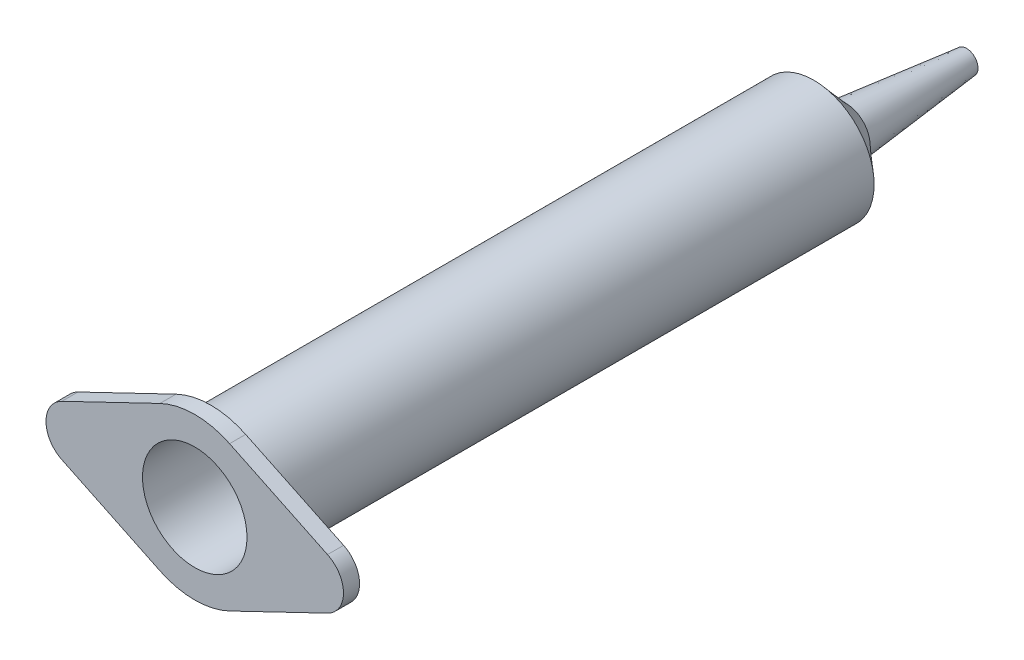
ISO-10303-21;
HEADER;
FILE_DESCRIPTION(('STEP AP214'),'2;1');
FILE_NAME('part.step','',(''),(''),'','','');
FILE_SCHEMA(('AUTOMOTIVE_DESIGN { 1 0 10303 214 1 1 1 1 }'));
ENDSEC;
DATA;
#1=APPLICATION_CONTEXT('core data for automotive mechanical design processes');
#2=APPLICATION_PROTOCOL_DEFINITION('international standard','automotive_design',2000,#1);
#3=PRODUCT_CONTEXT('',#1,'mechanical');
#4=PRODUCT('Part','Part','',(#3));
#5=PRODUCT_RELATED_PRODUCT_CATEGORY('part','',(#4));
#6=PRODUCT_DEFINITION_FORMATION('','',#4);
#7=PRODUCT_DEFINITION_CONTEXT('part definition',#1,'design');
#8=PRODUCT_DEFINITION('design','',#6,#7);
#9=PRODUCT_DEFINITION_SHAPE('','',#8);
#10=(LENGTH_UNIT() NAMED_UNIT(*) SI_UNIT(.MILLI.,.METRE.));
#11=(NAMED_UNIT(*) PLANE_ANGLE_UNIT() SI_UNIT($,.RADIAN.));
#12=(NAMED_UNIT(*) SI_UNIT($,.STERADIAN.) SOLID_ANGLE_UNIT());
#13=UNCERTAINTY_MEASURE_WITH_UNIT(LENGTH_MEASURE(1.E-05),#10,'distance_accuracy_value','');
#14=(GEOMETRIC_REPRESENTATION_CONTEXT(3) GLOBAL_UNCERTAINTY_ASSIGNED_CONTEXT((#13)) GLOBAL_UNIT_ASSIGNED_CONTEXT((#10,
#11,#12)) REPRESENTATION_CONTEXT('',''));
#15=CARTESIAN_POINT('',(0.,0.,0.));
#16=DIRECTION('',(0.,0.,1.));
#17=DIRECTION('',(1.,0.,0.));
#18=AXIS2_PLACEMENT_3D('',#15,#16,#17);
#19=CARTESIAN_POINT('',(0.,0.,-25.6294964028776));
#20=DIRECTION('',(0.,0.,-1.));
#21=DIRECTION('',(-1.,0.,0.));
#22=AXIS2_PLACEMENT_3D('',#19,#20,#21);
#23=CYLINDRICAL_SURFACE('',#22,10.);
#24=CARTESIAN_POINT('',(0.,0.,-2.));
#25=DIRECTION('',(0.,0.,-1.));
#26=DIRECTION('',(-1.,0.,0.));
#27=AXIS2_PLACEMENT_3D('',#24,#25,#26);
#28=CIRCLE('',#27,10.);
#29=CARTESIAN_POINT('',(4.33333333333333,-9.01233722306385,-2.));
#30=VERTEX_POINT('',#29);
#31=CARTESIAN_POINT('',(-4.33333333333333,-9.01233722306385,-2.));
#32=VERTEX_POINT('',#31);
#33=EDGE_CURVE('E129',#30,#32,#28,.T.);
#34=ORIENTED_EDGE('',*,*,#33,.F.);
#35=DIRECTION('',(0.,0.,1.));
#36=VECTOR('',#35,1.);
#37=CARTESIAN_POINT('',(4.33333333333333,-9.01233722306385,-24.9256043177346));
#38=LINE('',#37,#36);
#39=CARTESIAN_POINT('',(4.33333333333333,-9.01233722306385,0.));
#40=VERTEX_POINT('',#39);
#41=EDGE_CURVE('E123',#30,#40,#38,.T.);
#42=ORIENTED_EDGE('',*,*,#41,.T.);
#43=CARTESIAN_POINT('',(0.,0.,0.));
#44=DIRECTION('',(0.,0.,-1.));
#45=DIRECTION('',(-1.,0.,0.));
#46=AXIS2_PLACEMENT_3D('',#43,#44,#45);
#47=CIRCLE('',#46,10.);
#48=CARTESIAN_POINT('',(-4.33333333333333,-9.01233722306385,0.));
#49=VERTEX_POINT('',#48);
#50=EDGE_CURVE('E128',#40,#49,#47,.T.);
#51=ORIENTED_EDGE('',*,*,#50,.T.);
#52=DIRECTION('',(0.,0.,1.));
#53=VECTOR('',#52,1.);
#54=CARTESIAN_POINT('',(-4.33333333333333,-9.01233722306385,-24.9256043177346));
#55=LINE('',#54,#53);
#56=EDGE_CURVE('E227',#32,#49,#55,.T.);
#57=ORIENTED_EDGE('',*,*,#56,.F.);
#58=EDGE_LOOP('',(#34,#42,#51,#57));
#59=FACE_BOUND('',#58,.T.);
#60=ADVANCED_FACE('F37',(#59),#23,.T.);
#61=CARTESIAN_POINT('',(0.,0.,-81.));
#62=DIRECTION('',(0.,0.,1.));
#63=DIRECTION('',(-1.,0.,0.));
#64=AXIS2_PLACEMENT_3D('',#61,#62,#63);
#65=CONICAL_SURFACE('',#64,3.,0.10471975511966);
#66=CARTESIAN_POINT('',(0.,0.,-96.));
#67=DIRECTION('',(0.,0.,-1.));
#68=DIRECTION('',(-1.,0.,0.));
#69=AXIS2_PLACEMENT_3D('',#66,#67,#68);
#70=CIRCLE('',#69,1.42343647101485);
#71=CARTESIAN_POINT('',(-1.42343647101485,0.,-96.));
#72=VERTEX_POINT('',#71);
#73=EDGE_CURVE('E12',#72,#72,#70,.T.);
#74=ORIENTED_EDGE('',*,*,#73,.F.);
#75=EDGE_LOOP('',(#74));
#76=FACE_BOUND('',#75,.T.);
#77=CARTESIAN_POINT('',(0.,0.,-81.));
#78=DIRECTION('',(0.,0.,-1.));
#79=DIRECTION('',(-1.,0.,0.));
#80=AXIS2_PLACEMENT_3D('',#77,#78,#79);
#81=CIRCLE('',#80,3.);
#82=CARTESIAN_POINT('',(-3.,0.,-81.));
#83=VERTEX_POINT('',#82);
#84=EDGE_CURVE('E46',#83,#83,#81,.T.);
#85=ORIENTED_EDGE('',*,*,#84,.T.);
#86=EDGE_LOOP('',(#85));
#87=FACE_BOUND('',#86,.T.);
#88=ADVANCED_FACE('F39',(#76,#87),#65,.T.);
#89=CARTESIAN_POINT('',(0.,0.,-96.));
#90=DIRECTION('',(0.,0.,-1.));
#91=DIRECTION('',(-1.,0.,0.));
#92=AXIS2_PLACEMENT_3D('',#89,#90,#91);
#93=PLANE('',#92);
#94=CARTESIAN_POINT('',(0.,0.,-96.));
#95=DIRECTION('',(0.,0.,-1.));
#96=DIRECTION('',(-1.,0.,0.));
#97=AXIS2_PLACEMENT_3D('',#94,#95,#96);
#98=CIRCLE('',#97,1.05978906930928);
#99=CARTESIAN_POINT('',(-1.05978906930928,0.,-96.));
#100=VERTEX_POINT('',#99);
#101=EDGE_CURVE('E211',#100,#100,#98,.T.);
#102=ORIENTED_EDGE('',*,*,#101,.F.);
#103=EDGE_LOOP('',(#102));
#104=FACE_BOUND('',#103,.T.);
#105=ORIENTED_EDGE('',*,*,#73,.T.);
#106=EDGE_LOOP('',(#105));
#107=FACE_BOUND('',#106,.T.);
#108=ADVANCED_FACE('F157',(#104,#107),#93,.T.);
#109=CARTESIAN_POINT('',(-6.72480777588927,3.32068673279176,-77.));
#110=CARTESIAN_POINT('',(-2.22901400037884,2.00785870671099,-81.));
#111=CARTESIAN_POINT('',(-0.0834343103057467,16.7703022845703,-77.));
#112=CARTESIAN_POINT('',(1.78670341304313,6.46588670746867,-81.));
#113=CARTESIAN_POINT('',(13.3661812414728,10.1289288189868,-77.));
#114=CARTESIAN_POINT('',(6.24473141380081,2.4501692940467,-81.));
#115=CARTESIAN_POINT('',(6.72480777588927,-3.32068673279176,-77.));
#116=CARTESIAN_POINT('',(2.22901400037884,-2.00785870671099,-81.));
#117=CARTESIAN_POINT('',(0.083434310305751,-16.7703022845703,-77.));
#118=CARTESIAN_POINT('',(-1.78670341304313,-6.46588670746867,-81.));
#119=CARTESIAN_POINT('',(-13.3661812414728,-10.1289288189868,-77.));
#120=CARTESIAN_POINT('',(-6.24473141380082,-2.4501692940467,-81.));
#121=CARTESIAN_POINT('',(-6.72480777588927,3.32068673279176,-77.));
#122=CARTESIAN_POINT('',(-2.22901400037884,2.00785870671099,-81.));
#123=(BOUNDED_SURFACE() B_SPLINE_SURFACE(3,1,((#109,#110),(#111,#112),(#113,#114),(#115,#116),
(#117,#118),(#119,#120),(#121,#122)),.UNSPECIFIED.,.T.,.F.,.F.) B_SPLINE_SURFACE_WITH_KNOTS((4,
3,4),(2,2),(0.,0.5,1.),(0.,1.),
.UNSPECIFIED.) GEOMETRIC_REPRESENTATION_ITEM() RATIONAL_B_SPLINE_SURFACE(((1.,1.),
(0.333333333333333,0.333333333333333),(0.333333333333333,0.333333333333333),(1.,1.),
(0.333333333333333,0.333333333333333),(0.333333333333333,0.333333333333333),(1.,1.))) REPRESENTATION_ITEM('') SURFACE());
#124=CARTESIAN_POINT('',(-7.90055021050672E-13,7.50000000000446,-76.9999999999961));
#125=CARTESIAN_POINT('',(0.074339215918593,7.50000035297195,-76.9999999999961));
#126=CARTESIAN_POINT('',(0.148678432634289,7.49889475015923,-76.9999999999961));
#127=CARTESIAN_POINT('',(0.297775530849122,7.49445974691544,-76.9999999999961));
#128=CARTESIAN_POINT('',(0.372532982826332,7.49111589823005,-76.9999999999961));
#129=CARTESIAN_POINT('',(0.522369048424372,7.48216532422947,-76.9999999999961));
#130=CARTESIAN_POINT('',(0.597446846794247,7.47654494761892,-76.9999999999961));
#131=CARTESIAN_POINT('',(0.747822751889277,7.46300825476129,-76.9999999999961));
#132=CARTESIAN_POINT('',(0.823119707455567,7.45507914860886,-76.9999999999961));
#133=CARTESIAN_POINT('',(0.973830082678455,7.43689760424029,-76.9999999999961));
#134=CARTESIAN_POINT('',(1.04924207017639,7.42663329324561,-76.9999999999961));
#135=CARTESIAN_POINT('',(1.20007609300633,7.40376009100366,-76.9999999999961));
#136=CARTESIAN_POINT('',(1.27549647492435,7.39114029567602,-76.9999999999961));
#137=CARTESIAN_POINT('',(1.42623874236656,7.36354122997924,-76.9999999999961));
#138=CARTESIAN_POINT('',(1.50155881726946,7.34855206963513,-76.9999999999961));
#139=CARTESIAN_POINT('',(1.65199027280984,7.31620596529223,-76.9999999999961));
#140=CARTESIAN_POINT('',(1.72709975340314,7.29884018437048,-76.9999999999961));
#141=CARTESIAN_POINT('',(1.87699866722048,7.26173929041576,-76.9999999999961));
#142=CARTESIAN_POINT('',(1.95178618184258,7.24199642535953,-76.9999999999961));
#143=CARTESIAN_POINT('',(2.10092917414737,7.2001467083021,-76.9999999999961));
#144=CARTESIAN_POINT('',(2.17528278789602,7.17803321346885,-76.9999999999961));
#145=CARTESIAN_POINT('',(2.32344588659421,7.13145456032104,-76.9999999999961));
#146=CARTESIAN_POINT('',(2.39725363708597,7.10698388471036,-76.9999999999961));
#147=CARTESIAN_POINT('',(2.54421335963813,7.05571020726208,-76.9999999999961));
#148=CARTESIAN_POINT('',(2.61736380228579,7.02890282177812,-76.9999999999961));
#149=CARTESIAN_POINT('',(2.76289825121006,6.97298206020994,-76.9999999999961));
#150=CARTESIAN_POINT('',(2.83528100859511,6.94386543383436,-76.9999999999961));
#151=CARTESIAN_POINT('',(2.97917096960812,6.88335945762128,-76.9999999999961));
#152=CARTESIAN_POINT('',(3.05067727938012,6.85196798207993,-76.9999999999961));
#153=CARTESIAN_POINT('',(3.19270731095488,6.78695238790242,-76.9999999999961));
#154=CARTESIAN_POINT('',(3.26323056662048,6.75332725096153,-76.9999999999961));
#155=CARTESIAN_POINT('',(3.40319006970325,6.68389105863923,-76.9999999999961));
#156=CARTESIAN_POINT('',(3.47262634869982,6.64808006691097,-76.9999999999961));
#157=CARTESIAN_POINT('',(3.6103106054949,6.57432531580216,-76.9999999999961));
#158=CARTESIAN_POINT('',(3.67855917907861,6.53638266862083,-76.9999999999961));
#159=CARTESIAN_POINT('',(3.81377035016024,6.45842391830864,-76.9999999999961));
#160=CARTESIAN_POINT('',(3.88073416985307,6.4184099349322,-76.9999999999961));
#161=CARTESIAN_POINT('',(4.01328223944916,6.33637367528332,-76.9999999999961));
#162=CARTESIAN_POINT('',(4.07886839515893,6.29435447824425,-76.9999999999961));
#163=CARTESIAN_POINT('',(4.20857205504462,6.20837845532585,-76.9999999999961));
#164=CARTESIAN_POINT('',(4.2726922001953,6.16442561358357,-76.9999999999961));
#165=CARTESIAN_POINT('',(4.39937966402189,6.0746580783612,-76.9999999999961));
#166=CARTESIAN_POINT('',(4.46195040419223,6.02884821351661,-76.9999999999961));
#167=CARTESIAN_POINT('',(4.5854601432528,5.93544710370784,-76.9999999999961));
#168=CARTESIAN_POINT('',(4.64640338284144,5.88786146637363,-76.9999999999961));
#169=CARTESIAN_POINT('',(4.76658478231695,5.79099352339006,-76.9999999999961));
#170=CARTESIAN_POINT('',(4.82582803374031,5.74171753457677,-76.9999999999961));
#171=CARTESIAN_POINT('',(4.94254194408278,5.64155739249144,-76.9999999999961));
#172=CARTESIAN_POINT('',(5.00001856977502,5.59068019191809,-76.9999999999961));
#173=CARTESIAN_POINT('',(5.11313782434078,5.48740934820709,-76.9999999999961));
#174=CARTESIAN_POINT('',(5.16878731191653,5.43502321801127,-76.9999999999961));
#175=CARTESIAN_POINT('',(5.27819693017225,5.32882926973712,-76.9999999999961));
#176=CARTESIAN_POINT('',(5.33196482173581,5.27502944604996,-76.9999999999961));
#177=CARTESIAN_POINT('',(5.43756292819215,5.16610421874338,-76.9999999999961));
#178=CARTESIAN_POINT('',(5.4894018046518,5.11098721705208,-76.9999999999961));
#179=CARTESIAN_POINT('',(5.59109744223668,4.99952892264404,-76.9999999999961));
#180=CARTESIAN_POINT('',(5.64096377423413,4.94319634207136,-76.9999999999961));
#181=CARTESIAN_POINT('',(5.78706854608368,4.77305391230257,-76.9999999999961));
#182=CARTESIAN_POINT('',(5.88080398066736,4.65707591343124,-76.9999999999961));
#183=CARTESIAN_POINT('',(6.0599438307711,4.42139013717522,-76.9999999999961));
#184=CARTESIAN_POINT('',(6.14544551626952,4.30175610222955,-76.9999999999961));
#185=CARTESIAN_POINT('',(6.30800963463266,4.05955121152,-76.9999999999961));
#186=CARTESIAN_POINT('',(6.38518187937688,3.93705409783262,-76.9999999999961));
#187=CARTESIAN_POINT('',(6.53106327662253,3.68991234065501,-76.9999999999961));
#188=CARTESIAN_POINT('',(6.59989363593196,3.56533921523529,-76.9999999999961));
#189=CARTESIAN_POINT('',(6.72915917922511,3.31480307154892,-76.9999999999961));
#190=CARTESIAN_POINT('',(6.78972536515982,3.18890763370377,-76.9999999999961));
#191=CARTESIAN_POINT('',(6.90260992133465,2.93644639525911,-76.9999999999961));
#192=CARTESIAN_POINT('',(6.95506738568195,2.80994277229031,-76.9999999999961));
#193=CARTESIAN_POINT('',(7.0519526114234,2.55693705192061,-76.9999999999962));
#194=CARTESIAN_POINT('',(7.09652575241989,2.43049060998238,-76.9999999999962));
#195=CARTESIAN_POINT('',(7.17792061992301,2.17821740581947,-76.9999999999961));
#196=CARTESIAN_POINT('',(7.21489219466175,2.05243897498508,-76.9999999999961));
#197=CARTESIAN_POINT('',(7.28141192158451,1.80206180214235,-76.9999999999961));
#198=CARTESIAN_POINT('',(7.3111126194595,1.67750357156736,-76.9999999999961));
#199=CARTESIAN_POINT('',(7.36345788612425,1.43006623427706,-76.9999999999961));
#200=CARTESIAN_POINT('',(7.38625602524684,1.30721959865641,-76.9999999999961));
#201=CARTESIAN_POINT('',(7.42519285026916,1.06364355039292,-76.9999999999961));
#202=CARTESIAN_POINT('',(7.44148459517703,0.942938588502801,-76.9999999999961));
#203=CARTESIAN_POINT('',(7.46782546169894,0.704023350903386,-76.9999999999961));
#204=CARTESIAN_POINT('',(7.47802575913875,0.58582972644598,-76.9999999999961));
#205=CARTESIAN_POINT('',(7.49261235066327,0.352255892829089,-76.9999999999961));
#206=CARTESIAN_POINT('',(7.4971467457565,0.236884916771649,-76.9999999999961));
#207=CARTESIAN_POINT('',(7.50083454333913,0.00921922747196299,-76.9999999999961));
#208=CARTESIAN_POINT('',(7.50013196713451,-0.103073168088871,-76.9999999999961));
#209=CARTESIAN_POINT('',(7.49377683653004,-0.324371169456417,-76.9999999999961));
#210=CARTESIAN_POINT('',(7.48826340410943,-0.433380785117732,-76.9999999999961));
#211=CARTESIAN_POINT('',(7.47271020442822,-0.647950971680594,-76.9999999999961));
#212=CARTESIAN_POINT('',(7.46280401769005,-0.753521239172544,-76.9999999999961));
#213=CARTESIAN_POINT('',(7.43887718375935,-0.961094404886563,-76.9999999999961));
#214=CARTESIAN_POINT('',(7.42498409862126,-1.06311202036946,-76.9999999999961));
#215=CARTESIAN_POINT('',(7.3934800898855,-1.26350101948487,-76.9999999999961));
#216=CARTESIAN_POINT('',(7.37599038252676,-1.36189147257961,-76.9999999999961));
#217=CARTESIAN_POINT('',(7.33767184980403,-1.55498228655005,-76.9999999999961));
#218=CARTESIAN_POINT('',(7.31695769996435,-1.64970541639507,-76.9999999999961));
#219=CARTESIAN_POINT('',(7.27254919566301,-1.83544838215912,-76.9999999999961));
#220=CARTESIAN_POINT('',(7.24896289567012,-1.92649406345544,-76.9999999999961));
#221=CARTESIAN_POINT('',(7.19914794034054,-2.10489544287331,-76.9999999999961));
#222=CARTESIAN_POINT('',(7.17302073492166,-2.19227947919457,-76.9999999999961));
#223=CARTESIAN_POINT('',(7.11844005109692,-2.36339350022602,-76.9999999999961));
#224=CARTESIAN_POINT('',(7.09008151448703,-2.44715377845507,-76.9999999999962));
#225=CARTESIAN_POINT('',(7.0313322432293,-2.6110752380941,-76.9999999999961));
#226=CARTESIAN_POINT('',(7.00103010295744,-2.69126818062487,-76.9999999999961));
#227=CARTESIAN_POINT('',(6.93866583367815,-2.84812565812433,-76.9999999999961));
#228=CARTESIAN_POINT('',(6.90668616231877,-2.92482298550812,-76.9999999999961));
#229=CARTESIAN_POINT('',(6.84121760680643,-3.07477270689756,-76.9999999999962));
#230=CARTESIAN_POINT('',(6.8078052920677,-3.14805853887245,-76.9999999999961));
#231=CARTESIAN_POINT('',(6.73940722830823,-3.29189768279616,-76.9999999999961));
#232=CARTESIAN_POINT('',(6.70447302723933,-3.36247551261892,-76.9999999999961));
#233=CARTESIAN_POINT('',(6.63151052428692,-3.50422285580197,-76.9999999999961));
#234=CARTESIAN_POINT('',(6.59342716335805,-3.57536403522118,-76.9999999999961));
#235=CARTESIAN_POINT('',(6.51374134341847,-3.7186156929895,-76.9999999999961));
#236=CARTESIAN_POINT('',(6.4720655999976,-3.79068541357614,-76.9999999999961));
#237=CARTESIAN_POINT('',(6.38498217667814,-3.93565456071149,-76.9999999999961));
#238=CARTESIAN_POINT('',(6.3394981528373,-4.00850813645955,-76.9999999999961));
#239=CARTESIAN_POINT('',(6.24458224966337,-4.15488134018555,-76.9999999999961));
#240=CARTESIAN_POINT('',(6.19507112571189,-4.22834959201215,-76.9999999999961));
#241=CARTESIAN_POINT('',(6.0918839956924,-4.37576230647287,-76.9999999999961));
#242=CARTESIAN_POINT('',(6.03812606666511,-4.44964943534371,-76.9999999999961));
#243=CARTESIAN_POINT('',(5.92622960257561,-4.59768174706029,-76.9999999999961));
#244=CARTESIAN_POINT('',(5.86800676025309,-4.67176321529176,-76.9999999999961));
#245=CARTESIAN_POINT('',(5.74696892240796,-4.81993570377458,-76.9999999999961));
#246=CARTESIAN_POINT('',(5.68406760837845,-4.89395622691165,-76.9999999999961));
#247=CARTESIAN_POINT('',(5.55346883448554,-5.04172611148933,-76.9999999999961));
#248=CARTESIAN_POINT('',(5.48568350345388,-5.11539782806795,-76.9999999999961));
#249=CARTESIAN_POINT('',(5.34512416536147,-5.26215556389304,-76.9999999999961));
#250=CARTESIAN_POINT('',(5.27226128354547,-5.33515647928046,-76.9999999999962));
#251=CARTESIAN_POINT('',(5.12137022969172,-5.48022300641735,-76.9999999999962));
#252=CARTESIAN_POINT('',(5.04325282161439,-5.55219581830749,-76.9999999999961));
#253=CARTESIAN_POINT('',(4.88169701443223,-5.6948206949122,-76.9999999999961));
#254=CARTESIAN_POINT('',(4.79816975323146,-5.76537212375679,-76.9999999999961));
#255=CARTESIAN_POINT('',(4.62566496976813,-5.90473280281742,-76.9999999999961));
#256=CARTESIAN_POINT('',(4.53659978327897,-5.97343356296304,-76.9999999999961));
#257=CARTESIAN_POINT('',(4.35292229595508,-6.10863609441369,-76.9999999999961));
#258=CARTESIAN_POINT('',(4.25822443231661,-6.17502165130697,-76.9999999999961));
#259=CARTESIAN_POINT('',(4.06322352425223,-6.30510310567846,-76.9999999999961));
#260=CARTESIAN_POINT('',(3.9628379868302,-6.36867536893604,-76.9999999999961));
#261=CARTESIAN_POINT('',(3.75644908348784,-6.49260828093655,-76.9999999999961));
#262=CARTESIAN_POINT('',(3.65036730631908,-6.55283838052062,-76.9999999999961));
#263=CARTESIAN_POINT('',(3.4326254231111,-6.66953749701702,-76.9999999999961));
#264=CARTESIAN_POINT('',(3.32089201476731,-6.72586977802909,-76.9999999999961));
#265=CARTESIAN_POINT('',(3.09194513543002,-6.8342013607548,-76.9999999999961));
#266=CARTESIAN_POINT('',(2.9746644781313,-6.88605870961565,-76.9999999999961));
#267=CARTESIAN_POINT('',(2.73478638191119,-6.98485258429964,-76.9999999999961));
#268=CARTESIAN_POINT('',(2.61212881715372,-7.03164316292668,-76.9999999999961));
#269=CARTESIAN_POINT('',(2.36173082424849,-7.11970762241235,-76.9999999999961));
#270=CARTESIAN_POINT('',(2.23393816523341,-7.16083303896152,-76.9999999999961));
#271=CARTESIAN_POINT('',(1.97357906971015,-7.23697258981596,-76.9999999999961));
#272=CARTESIAN_POINT('',(1.84096896711801,-7.27183746441842,-76.9999999999961));
#273=CARTESIAN_POINT('',(1.57136288623116,-7.33487328332991,-76.9999999999961));
#274=CARTESIAN_POINT('',(1.43433226732146,-7.36289611517176,-76.9999999999961));
#275=CARTESIAN_POINT('',(1.15635217171521,-7.41168885009121,-76.9999999999961));
#276=CARTESIAN_POINT('',(1.01537724598793,-7.43231391112857,-76.9999999999961));
#277=CARTESIAN_POINT('',(0.730059463146597,-7.46578854207101,-76.9999999999961));
#278=CARTESIAN_POINT('',(0.585700293100373,-7.47849879326285,-76.9999999999961));
#279=CARTESIAN_POINT('',(0.294226568787898,-7.49567008777252,-76.9999999999961));
#280=CARTESIAN_POINT('',(0.147104104600564,-7.49999963372592,-76.9999999999961));
#281=CARTESIAN_POINT('',(-0.074341924932309,-7.50000018511045,-76.9999999999961));
#282=CARTESIAN_POINT('',(-0.148679160857739,-7.49889470503554,-76.9999999999961));
#283=CARTESIAN_POINT('',(-0.297774797878941,-7.49445979233325,-76.9999999999961));
#284=CARTESIAN_POINT('',(-0.372532785835046,-7.49111591043643,-76.9999999999961));
#285=CARTESIAN_POINT('',(-0.522369246614834,-7.48216531194879,-76.9999999999961));
#286=CARTESIAN_POINT('',(-0.597446900047841,-7.47654494431911,-76.9999999999961));
#287=CARTESIAN_POINT('',(-0.747822698334861,-7.46300825807974,-76.9999999999961));
#288=CARTESIAN_POINT('',(-0.82311969306873,-7.45507914950033,-76.9999999999961));
#289=CARTESIAN_POINT('',(-0.973830097140139,-7.43689760334419,-76.9999999999961));
#290=CARTESIAN_POINT('',(-1.04924207406049,-7.42663329300493,-76.9999999999961));
#291=CARTESIAN_POINT('',(-1.20007608910377,-7.40376009124547,-76.9999999999961));
#292=CARTESIAN_POINT('',(-1.27549647387645,-7.39114029574095,-76.9999999999961));
#293=CARTESIAN_POINT('',(-1.42623874341896,-7.36354122991403,-76.9999999999961));
#294=CARTESIAN_POINT('',(-1.50155881755198,-7.34855206961762,-76.9999999999961));
#295=CARTESIAN_POINT('',(-1.65199027252624,-7.3162059653098,-76.9999999999961));
#296=CARTESIAN_POINT('',(-1.72709975332702,-7.29884018437519,-76.9999999999961));
#297=CARTESIAN_POINT('',(-1.87699866729685,-7.26173929041103,-76.9999999999961));
#298=CARTESIAN_POINT('',(-1.95178618186307,-7.24199642535825,-76.9999999999961));
#299=CARTESIAN_POINT('',(-2.10092917412682,-7.20014670830338,-76.9999999999961));
#300=CARTESIAN_POINT('',(-2.17528278789051,-7.17803321346919,-76.9999999999961));
#301=CARTESIAN_POINT('',(-2.32344588659974,-7.13145456032069,-76.9999999999961));
#302=CARTESIAN_POINT('',(-2.39725363708745,-7.10698388471027,-76.9999999999961));
#303=CARTESIAN_POINT('',(-2.54421335963664,-7.05571020726217,-76.9999999999961));
#304=CARTESIAN_POINT('',(-2.61736380228539,-7.02890282177814,-76.9999999999961));
#305=CARTESIAN_POINT('',(-2.76289825121046,-6.97298206020991,-76.9999999999961));
#306=CARTESIAN_POINT('',(-2.83528100859522,-6.94386543383436,-76.9999999999961));
#307=CARTESIAN_POINT('',(-2.97917096960801,-6.88335945762128,-76.9999999999961));
#308=CARTESIAN_POINT('',(-3.05067727938009,-6.85196798207993,-76.9999999999961));
#309=CARTESIAN_POINT('',(-3.19270731095491,-6.78695238790242,-76.9999999999961));
#310=CARTESIAN_POINT('',(-3.26323056662048,-6.75332725096153,-76.9999999999961));
#311=CARTESIAN_POINT('',(-3.40319006970325,-6.68389105863922,-76.9999999999961));
#312=CARTESIAN_POINT('',(-3.47262634869982,-6.64808006691097,-76.9999999999961));
#313=CARTESIAN_POINT('',(-3.6103106054949,-6.57432531580215,-76.9999999999961));
#314=CARTESIAN_POINT('',(-3.67855917907861,-6.53638266862083,-76.9999999999961));
#315=CARTESIAN_POINT('',(-3.81377035016024,-6.45842391830864,-76.9999999999961));
#316=CARTESIAN_POINT('',(-3.88073416985307,-6.4184099349322,-76.9999999999961));
#317=CARTESIAN_POINT('',(-4.01328223944916,-6.33637367528331,-76.9999999999961));
#318=CARTESIAN_POINT('',(-4.07886839515893,-6.29435447824425,-76.9999999999961));
#319=CARTESIAN_POINT('',(-4.20857205504462,-6.20837845532585,-76.9999999999961));
#320=CARTESIAN_POINT('',(-4.2726922001953,-6.16442561358357,-76.9999999999961));
#321=CARTESIAN_POINT('',(-4.39937966402189,-6.0746580783612,-76.9999999999961));
#322=CARTESIAN_POINT('',(-4.46195040419223,-6.02884821351661,-76.9999999999961));
#323=CARTESIAN_POINT('',(-4.5854601432528,-5.93544710370784,-76.9999999999961));
#324=CARTESIAN_POINT('',(-4.64640338284144,-5.88786146637363,-76.9999999999961));
#325=CARTESIAN_POINT('',(-4.76658478231695,-5.79099352339006,-76.9999999999961));
#326=CARTESIAN_POINT('',(-4.82582803374031,-5.74171753457677,-76.9999999999961));
#327=CARTESIAN_POINT('',(-4.94254194408277,-5.64155739249144,-76.9999999999961));
#328=CARTESIAN_POINT('',(-5.00001856977502,-5.59068019191808,-76.9999999999961));
#329=CARTESIAN_POINT('',(-5.11313782434077,-5.48740934820709,-76.9999999999961));
#330=CARTESIAN_POINT('',(-5.16878731191653,-5.43502321801127,-76.9999999999961));
#331=CARTESIAN_POINT('',(-5.27819693017225,-5.32882926973712,-76.9999999999961));
#332=CARTESIAN_POINT('',(-5.33196482173581,-5.27502944604996,-76.9999999999961));
#333=CARTESIAN_POINT('',(-5.43756292819215,-5.16610421874338,-76.9999999999961));
#334=CARTESIAN_POINT('',(-5.4894018046518,-5.11098721705208,-76.9999999999961));
#335=CARTESIAN_POINT('',(-5.59109744223668,-4.99952892264404,-76.9999999999961));
#336=CARTESIAN_POINT('',(-5.64096377423412,-4.94319634207136,-76.9999999999961));
#337=CARTESIAN_POINT('',(-5.78706854608368,-4.77305391230257,-76.9999999999961));
#338=CARTESIAN_POINT('',(-5.88080398066736,-4.65707591343124,-76.9999999999961));
#339=CARTESIAN_POINT('',(-6.05994383077109,-4.42139013717522,-76.9999999999961));
#340=CARTESIAN_POINT('',(-6.14544551626952,-4.30175610222955,-76.9999999999961));
#341=CARTESIAN_POINT('',(-6.30800963463267,-4.05955121152,-76.9999999999961));
#342=CARTESIAN_POINT('',(-6.38518187937688,-3.93705409783262,-76.9999999999961));
#343=CARTESIAN_POINT('',(-6.53106327662253,-3.68991234065501,-76.9999999999961));
#344=CARTESIAN_POINT('',(-6.59989363593196,-3.56533921523529,-76.9999999999961));
#345=CARTESIAN_POINT('',(-6.7291591792251,-3.31480307154892,-76.9999999999961));
#346=CARTESIAN_POINT('',(-6.78972536515982,-3.18890763370377,-76.9999999999961));
#347=CARTESIAN_POINT('',(-6.90260992133465,-2.93644639525911,-76.9999999999961));
#348=CARTESIAN_POINT('',(-6.95506738568195,-2.80994277229031,-76.9999999999961));
#349=CARTESIAN_POINT('',(-7.0519526114234,-2.55693705192061,-76.9999999999962));
#350=CARTESIAN_POINT('',(-7.09652575241989,-2.43049060998238,-76.9999999999962));
#351=CARTESIAN_POINT('',(-7.17792061992301,-2.17821740581947,-76.9999999999961));
#352=CARTESIAN_POINT('',(-7.21489219466175,-2.05243897498508,-76.9999999999961));
#353=CARTESIAN_POINT('',(-7.28141192158451,-1.80206180214235,-76.9999999999961));
#354=CARTESIAN_POINT('',(-7.3111126194595,-1.67750357156736,-76.9999999999961));
#355=CARTESIAN_POINT('',(-7.36345788612425,-1.43006623427706,-76.9999999999961));
#356=CARTESIAN_POINT('',(-7.38625602524684,-1.3072195986564,-76.9999999999961));
#357=CARTESIAN_POINT('',(-7.42519285026916,-1.06364355039292,-76.9999999999961));
#358=CARTESIAN_POINT('',(-7.44148459517702,-0.942938588502799,-76.9999999999961));
#359=CARTESIAN_POINT('',(-7.46782546169894,-0.704023350903385,-76.9999999999961));
#360=CARTESIAN_POINT('',(-7.47802575913875,-0.585829726445978,-76.9999999999961));
#361=CARTESIAN_POINT('',(-7.49261235066327,-0.352255892829088,-76.9999999999961));
#362=CARTESIAN_POINT('',(-7.4971467457565,-0.236884916771647,-76.9999999999961));
#363=CARTESIAN_POINT('',(-7.50083454333913,-0.00921922747196147,-76.9999999999961));
#364=CARTESIAN_POINT('',(-7.50013196713451,0.103073168088872,-76.9999999999961));
#365=CARTESIAN_POINT('',(-7.49377683653004,0.324371169456419,-76.9999999999961));
#366=CARTESIAN_POINT('',(-7.48826340410943,0.433380785117734,-76.9999999999961));
#367=CARTESIAN_POINT('',(-7.47271020442822,0.647950971680596,-76.9999999999961));
#368=CARTESIAN_POINT('',(-7.46280401769005,0.753521239172546,-76.9999999999961));
#369=CARTESIAN_POINT('',(-7.43887718375935,0.961094404886564,-76.9999999999961));
#370=CARTESIAN_POINT('',(-7.42498409862126,1.06311202036946,-76.9999999999961));
#371=CARTESIAN_POINT('',(-7.3934800898855,1.26350101948487,-76.9999999999961));
#372=CARTESIAN_POINT('',(-7.37599038252676,1.36189147257961,-76.9999999999961));
#373=CARTESIAN_POINT('',(-7.33767184980403,1.55498228655005,-76.9999999999961));
#374=CARTESIAN_POINT('',(-7.31695769996435,1.64970541639507,-76.9999999999961));
#375=CARTESIAN_POINT('',(-7.27254919566301,1.83544838215913,-76.9999999999961));
#376=CARTESIAN_POINT('',(-7.24896289567012,1.92649406345545,-76.9999999999961));
#377=CARTESIAN_POINT('',(-7.19914794034054,2.10489544287331,-76.9999999999961));
#378=CARTESIAN_POINT('',(-7.17302073492166,2.19227947919457,-76.9999999999961));
#379=CARTESIAN_POINT('',(-7.11844005109692,2.36339350022603,-76.9999999999961));
#380=CARTESIAN_POINT('',(-7.09008151448703,2.44715377845508,-76.9999999999962));
#381=CARTESIAN_POINT('',(-7.0313322432293,2.6110752380941,-76.9999999999961));
#382=CARTESIAN_POINT('',(-7.00103010295744,2.69126818062487,-76.9999999999961));
#383=CARTESIAN_POINT('',(-6.93866583367815,2.84812565812433,-76.9999999999961));
#384=CARTESIAN_POINT('',(-6.90668616231877,2.92482298550813,-76.9999999999961));
#385=CARTESIAN_POINT('',(-6.84121760680643,3.07477270689757,-76.9999999999962));
#386=CARTESIAN_POINT('',(-6.8078052920677,3.14805853887245,-76.9999999999961));
#387=CARTESIAN_POINT('',(-6.73940722830823,3.29189768279616,-76.9999999999961));
#388=CARTESIAN_POINT('',(-6.70447302723933,3.36247551261892,-76.9999999999961));
#389=CARTESIAN_POINT('',(-6.63151052428692,3.50422285580197,-76.9999999999961));
#390=CARTESIAN_POINT('',(-6.59342716335805,3.57536403522118,-76.9999999999961));
#391=CARTESIAN_POINT('',(-6.51374134341847,3.7186156929895,-76.9999999999961));
#392=CARTESIAN_POINT('',(-6.4720655999976,3.79068541357614,-76.9999999999961));
#393=CARTESIAN_POINT('',(-6.38498217667814,3.9356545607115,-76.9999999999961));
#394=CARTESIAN_POINT('',(-6.3394981528373,4.00850813645956,-76.9999999999961));
#395=CARTESIAN_POINT('',(-6.24458224966337,4.15488134018556,-76.9999999999961));
#396=CARTESIAN_POINT('',(-6.19507112571189,4.22834959201215,-76.9999999999961));
#397=CARTESIAN_POINT('',(-6.0918839956924,4.37576230647287,-76.9999999999961));
#398=CARTESIAN_POINT('',(-6.03812606666511,4.44964943534371,-76.9999999999961));
#399=CARTESIAN_POINT('',(-5.92622960257561,4.59768174706029,-76.9999999999961));
#400=CARTESIAN_POINT('',(-5.86800676025309,4.67176321529177,-76.9999999999961));
#401=CARTESIAN_POINT('',(-5.74696892240796,4.81993570377459,-76.9999999999961));
#402=CARTESIAN_POINT('',(-5.68406760837845,4.89395622691165,-76.9999999999961));
#403=CARTESIAN_POINT('',(-5.55346883448554,5.04172611148933,-76.9999999999961));
#404=CARTESIAN_POINT('',(-5.48568350345388,5.11539782806795,-76.9999999999961));
#405=CARTESIAN_POINT('',(-5.34512416536146,5.26215556389304,-76.9999999999961));
#406=CARTESIAN_POINT('',(-5.27226128354545,5.33515647928045,-76.9999999999962));
#407=CARTESIAN_POINT('',(-5.12137022969174,5.48022300641736,-76.9999999999962));
#408=CARTESIAN_POINT('',(-5.04325282161445,5.55219581830752,-76.9999999999961));
#409=CARTESIAN_POINT('',(-4.88169701443216,5.69482069491216,-76.9999999999961));
#410=CARTESIAN_POINT('',(-4.7981697532312,5.76537212375665,-76.9999999999961));
#411=CARTESIAN_POINT('',(-4.6256649697684,5.90473280281756,-76.9999999999961));
#412=CARTESIAN_POINT('',(-4.53659978327998,5.97343356296356,-76.9999999999961));
#413=CARTESIAN_POINT('',(-4.35292229595404,6.10863609441316,-76.9999999999961));
#414=CARTESIAN_POINT('',(-4.25822443231267,6.17502165130496,-76.9999999999961));
#415=CARTESIAN_POINT('',(-4.06322352425627,6.30510310568053,-76.9999999999961));
#416=CARTESIAN_POINT('',(-3.96283798684551,6.36867536894387,-76.9999999999961));
#417=CARTESIAN_POINT('',(-3.75644908347212,6.49260828092851,-76.9999999999961));
#418=CARTESIAN_POINT('',(-3.65036730625962,6.5528383804902,-76.9999999999961));
#419=CARTESIAN_POINT('',(-3.43262542317208,6.66953749704822,-76.9999999999961));
#420=CARTESIAN_POINT('',(-3.32089201499783,6.72586977814704,-76.9999999999961));
#421=CARTESIAN_POINT('',(-3.09194513519378,6.83420136063392,-76.9999999999961));
#422=CARTESIAN_POINT('',(-2.9746644772387,6.88605870915891,-76.9999999999961));
#423=CARTESIAN_POINT('',(-2.73478638282497,6.98485258476721,-76.9999999999961));
#424=CARTESIAN_POINT('',(-2.61212882060462,7.03164316469248,-76.9999999999961));
#425=CARTESIAN_POINT('',(-2.36173082071965,7.11970762060666,-76.9999999999961));
#426=CARTESIAN_POINT('',(-2.23393815191418,7.16083303214617,-76.9999999999961));
#427=CARTESIAN_POINT('',(-1.97357908331381,7.23697259677686,-76.9999999999961));
#428=CARTESIAN_POINT('',(-1.8409690184325,7.27183749067569,-76.9999999999961));
#429=CARTESIAN_POINT('',(-1.57136283388855,7.33487325654656,-76.9999999999961));
#430=CARTESIAN_POINT('',(-1.43433207000783,7.36289601420775,-76.9999999999961));
#431=CARTESIAN_POINT('',(-1.15635237270465,7.4116889529361,-76.9999999999961));
#432=CARTESIAN_POINT('',(-1.01537800312327,7.43231429854944,-76.9999999999961));
#433=CARTESIAN_POINT('',(-0.73005869303507,7.46578814801032,-76.9999999999961));
#434=CARTESIAN_POINT('',(-0.585697394194905,7.47849730991314,-76.9999999999961));
#435=CARTESIAN_POINT('',(-0.294229512821245,7.49567159421386,-76.9999999999961));
#436=CARTESIAN_POINT('',(-0.147115178119617,7.50000529996843,-76.9999999999961));
#437=CARTESIAN_POINT('',(-7.90055021050672E-13,7.50000000000446,-76.9999999999961));
#438=B_SPLINE_CURVE_WITH_KNOTS('',3,(#124,#125,#126,#127,#128,#129,#130,#131,#132,#133,#134,
#135,#136,#137,#138,#139,#140,#141,#142,#143,#144,#145,#146,#147,#148,#149,#150,#151,#152,#153,
#154,#155,#156,#157,#158,#159,#160,#161,#162,#163,#164,#165,#166,#167,#168,#169,#170,#171,#172,
#173,#174,#175,#176,#177,#178,#179,#180,#181,#182,#183,#184,#185,#186,#187,#188,#189,#190,#191,
#192,#193,#194,#195,#196,#197,#198,#199,#200,#201,#202,#203,#204,#205,#206,#207,#208,#209,#210,
#211,#212,#213,#214,#215,#216,#217,#218,#219,#220,#221,#222,#223,#224,#225,#226,#227,#228,#229,
#230,#231,#232,#233,#234,#235,#236,#237,#238,#239,#240,#241,#242,#243,#244,#245,#246,#247,#248,
#249,#250,#251,#252,#253,#254,#255,#256,#257,#258,#259,#260,#261,#262,#263,#264,#265,#266,#267,
#268,#269,#270,#271,#272,#273,#274,#275,#276,#277,#278,#279,#280,#281,#282,#283,#284,#285,#286,
#287,#288,#289,#290,#291,#292,#293,#294,#295,#296,#297,#298,#299,#300,#301,#302,#303,#304,#305,
#306,#307,#308,#309,#310,#311,#312,#313,#314,#315,#316,#317,#318,#319,#320,#321,#322,#323,#324,
#325,#326,#327,#328,#329,#330,#331,#332,#333,#334,#335,#336,#337,#338,#339,#340,#341,#342,#343,
#344,#345,#346,#347,#348,#349,#350,#351,#352,#353,#354,#355,#356,#357,#358,#359,#360,#361,#362,
#363,#364,#365,#366,#367,#368,#369,#370,#371,#372,#373,#374,#375,#376,#377,#378,#379,#380,#381,
#382,#383,#384,#385,#386,#387,#388,#389,#390,#391,#392,#393,#394,#395,#396,#397,#398,#399,#400,
#401,#402,#403,#404,#405,#406,#407,#408,#409,#410,#411,#412,#413,#414,#415,#416,#417,#418,#419,
#420,#421,#422,#423,#424,#425,#426,#427,#428,#429,#430,#431,#432,#433,#434,#435,#436,#437),
.UNSPECIFIED.,.F.,.F.,(4,2,2,2,2,2,2,2,2,2,2,2,2,2,2,2,2,2,2,2,2,2,2,2,2,2,2,2,2,2,2,2,2,2,2,2,
2,2,2,2,2,2,2,2,2,2,2,2,2,2,2,2,2,2,2,2,2,2,2,2,2,2,2,2,2,2,2,2,2,2,2,2,2,2,2,2,2,2,2,2,2,2,2,2,
2,2,2,2,2,2,2,2,2,2,2,2,2,2,2,2,2,2,2,2,2,2,2,2,2,2,2,2,2,2,2,2,2,2,2,2,2,2,2,2,2,2,2,2,2,2,2,2,
2,2,2,2,2,2,2,2,2,2,2,2,2,2,2,2,2,2,2,2,2,2,2,2,4),(0.,0.223009456628881,0.447472540599604,
0.673302038450292,0.900407196080895,1.12869389390695,1.35806484308569,1.58841980209619,
1.81965581272301,2.0516674542638,2.28434711456036,2.51758527624302,2.75127081638484,
2.98529131758831,3.21953338837673,3.4538829906384,3.68822577177717,3.92244739915865,
4.15643389441064,4.39007196513796,4.62324933164738,4.85585504634538,5.08777980357058,
5.3189162377494,5.54915920791735,5.77840606682444,6.00655691303884,6.23351482467415,
6.45918607358767,6.90626111773087,7.34715462086635,7.78124887090092,8.20799048092801,
8.62689213031294,9.03753303465557,9.43955826074182,9.83267702829002,10.2166601560282,
10.5913368161323,10.9565907595369,11.3123561666277,11.6586132649692,11.9953838396165,
12.3227267436481,12.6407334980792,12.9495240522318,13.2492427586936,13.540054601663,
13.8221417040397,14.0957001271949,14.3609369679189,14.6180677495032,14.8673140980812,
15.1089016910472,15.3451141294033,15.5871520061387,15.836862174522,16.0944701231803,
16.360197174498,16.6342584172427,16.9168603662305,17.2081983360691,17.5084535204052,
17.8177897740331,18.136350102871,18.464252876363,18.8015877884121,19.1484116065053,
19.5047437641285,19.8705618686055,20.2457972146136,20.6303304121116,21.0239872552519,
21.4265349748035,21.8376790292243,22.2570605971826,22.6842549354096,23.1187707587493,
23.5600507829644,23.7830602395933,24.007523323564,24.2333528214147,24.4604579790453,
24.6887446768713,24.9181156260501,25.1484705850606,25.3797065956874,25.6117182372282,
25.8443978975247,26.0776360592074,26.3113215993492,26.5453421005527,26.7795841713411,
27.0139337736028,27.2482765547416,27.482498182123,27.716484677375,27.9501227481023,
28.1833001146118,28.4159058293098,28.647830586535,28.8789670207138,29.1092099908817,
29.3384568497888,29.5666076960032,29.7935656076385,30.0192368565521,30.4663119006952,
30.9072054038307,31.3412996538653,31.7680412638924,32.1869429132773,32.5975838176199,
32.9996090437062,33.3927278112544,33.7767109389926,34.1513875990967,34.5166415425013,
34.872406949592,35.2186640479336,35.5554346225808,35.8827775266125,36.2007842810436,
36.5095748351962,36.809293541658,37.1001053846273,37.3821924870041,37.6557509101593,
37.9209877508833,38.1781185324676,38.4273648810456,38.6689524740116,38.9051649123677,
39.1472027891031,39.3969129574864,39.6545209061447,39.9202479574624,40.194309200207,
40.4769111491949,40.7682491190335,41.0685043033696,41.3778405569975,41.6964008858354,
42.0243036593274,42.3616385713765,42.7084623894696,43.0647945470929,43.4306126515699,
43.805847997578,44.190381195076,44.5840380382162,44.9865857577679,45.3977298121887,
45.817111380147,46.2443057183739,46.6788215417137,47.1201015659287),.UNSPECIFIED.);
#439=CARTESIAN_POINT('',(-7.90055021050672E-13,7.50000000000446,-76.9999999999961));
#440=VERTEX_POINT('',#439);
#441=EDGE_CURVE('E140',#440,#440,#438,.T.);
#442=ORIENTED_EDGE('',*,*,#441,.T.);
#443=EDGE_LOOP('',(#442));
#444=FACE_BOUND('',#443,.T.);
#445=ORIENTED_EDGE('',*,*,#84,.F.);
#446=EDGE_LOOP('',(#445));
#447=FACE_BOUND('',#446,.T.);
#448=ADVANCED_FACE('F145',(#444,#447),#123,.T.);
#449=CARTESIAN_POINT('',(0.,0.,0.));
#450=DIRECTION('',(0.,0.,1.));
#451=DIRECTION('',(1.,0.,0.));
#452=AXIS2_PLACEMENT_3D('',#449,#450,#451);
#453=PLANE('',#452);
#454=CARTESIAN_POINT('',(0.,0.,0.));
#455=DIRECTION('',(0.,0.,1.));
#456=DIRECTION('',(1.,0.,0.));
#457=AXIS2_PLACEMENT_3D('',#454,#455,#456);
#458=CIRCLE('',#457,6.5);
#459=CARTESIAN_POINT('',(6.5,0.,0.));
#460=VERTEX_POINT('',#459);
#461=EDGE_CURVE('E190',#460,#460,#458,.T.);
#462=ORIENTED_EDGE('',*,*,#461,.F.);
#463=EDGE_LOOP('',(#462));
#464=FACE_BOUND('',#463,.T.);
#465=CARTESIAN_POINT('',(-4.33333333333334,9.01233722306385,0.));
#466=VERTEX_POINT('',#465);
#467=CARTESIAN_POINT('',(4.33333333333334,9.01233722306385,0.));
#468=VERTEX_POINT('',#467);
#469=EDGE_CURVE('E122',#466,#468,#47,.T.);
#470=ORIENTED_EDGE('',*,*,#469,.F.);
#471=DIRECTION('',(-0.901233722306385,-0.433333333333334,0.));
#472=VECTOR('',#471,1.);
#473=CARTESIAN_POINT('',(-4.33333333333334,9.01233722306385,0.));
#474=LINE('',#473,#472);
#475=CARTESIAN_POINT('',(-16.5166666666667,3.15431802807234,0.));
#476=VERTEX_POINT('',#475);
#477=EDGE_CURVE('E193',#466,#476,#474,.T.);
#478=ORIENTED_EDGE('',*,*,#477,.T.);
#479=CARTESIAN_POINT('',(-15.,0.,0.));
#480=DIRECTION('',(0.,0.,1.));
#481=DIRECTION('',(1.,0.,0.));
#482=AXIS2_PLACEMENT_3D('',#479,#480,#481);
#483=CIRCLE('',#482,3.5);
#484=CARTESIAN_POINT('',(-16.5166666666667,-3.15431802807235,0.));
#485=VERTEX_POINT('',#484);
#486=EDGE_CURVE('E216',#476,#485,#483,.T.);
#487=ORIENTED_EDGE('',*,*,#486,.T.);
#488=DIRECTION('',(0.901233722306385,-0.433333333333333,0.));
#489=VECTOR('',#488,1.);
#490=CARTESIAN_POINT('',(-4.33333333333333,-9.01233722306385,0.));
#491=LINE('',#490,#489);
#492=EDGE_CURVE('E212',#485,#49,#491,.T.);
#493=ORIENTED_EDGE('',*,*,#492,.T.);
#494=ORIENTED_EDGE('',*,*,#50,.F.);
#495=DIRECTION('',(-0.901233722306385,-0.433333333333333,0.));
#496=VECTOR('',#495,1.);
#497=CARTESIAN_POINT('',(4.33333333333333,-9.01233722306385,0.));
#498=LINE('',#497,#496);
#499=CARTESIAN_POINT('',(16.5166666666667,-3.15431802807235,0.));
#500=VERTEX_POINT('',#499);
#501=EDGE_CURVE('E201',#500,#40,#498,.T.);
#502=ORIENTED_EDGE('',*,*,#501,.F.);
#503=CARTESIAN_POINT('',(15.,0.,0.));
#504=DIRECTION('',(0.,0.,1.));
#505=DIRECTION('',(1.,0.,0.));
#506=AXIS2_PLACEMENT_3D('',#503,#504,#505);
#507=CIRCLE('',#506,3.5);
#508=CARTESIAN_POINT('',(16.5166666666667,3.15431802807234,0.));
#509=VERTEX_POINT('',#508);
#510=EDGE_CURVE('E197',#509,#500,#507,.F.);
#511=ORIENTED_EDGE('',*,*,#510,.F.);
#512=DIRECTION('',(0.901233722306385,-0.433333333333334,0.));
#513=VECTOR('',#512,1.);
#514=CARTESIAN_POINT('',(4.33333333333334,9.01233722306385,0.));
#515=LINE('',#514,#513);
#516=EDGE_CURVE('E114',#468,#509,#515,.T.);
#517=ORIENTED_EDGE('',*,*,#516,.F.);
#518=EDGE_LOOP('',(#470,#478,#487,#493,#494,#502,#511,#517));
#519=FACE_BOUND('',#518,.T.);
#520=ADVANCED_FACE('F156',(#464,#519),#453,.T.);
#521=DIRECTION('',(0.,0.,1.));
#522=VECTOR('',#521,1.);
#523=CARTESIAN_POINT('',(4.33333333333334,9.01233722306385,-24.9256043177346));
#524=LINE('',#523,#522);
#525=CARTESIAN_POINT('',(4.33333333333334,9.01233722306385,-2.00000000000001));
#526=VERTEX_POINT('',#525);
#527=EDGE_CURVE('E108',#526,#468,#524,.T.);
#528=ORIENTED_EDGE('',*,*,#527,.F.);
#529=CARTESIAN_POINT('',(-4.33333333333334,9.01233722306385,-2.));
#530=VERTEX_POINT('',#529);
#531=EDGE_CURVE('E120',#530,#526,#28,.T.);
#532=ORIENTED_EDGE('',*,*,#531,.F.);
#533=DIRECTION('',(0.,0.,1.));
#534=VECTOR('',#533,1.);
#535=CARTESIAN_POINT('',(-4.33333333333334,9.01233722306385,-24.9256043177346));
#536=LINE('',#535,#534);
#537=EDGE_CURVE('E62',#530,#466,#536,.T.);
#538=ORIENTED_EDGE('',*,*,#537,.T.);
#539=ORIENTED_EDGE('',*,*,#469,.T.);
#540=EDGE_LOOP('',(#528,#532,#538,#539));
#541=FACE_BOUND('',#540,.T.);
#542=ADVANCED_FACE('F119',(#541),#23,.T.);
#543=CARTESIAN_POINT('',(-10.,0.,-2.));
#544=DIRECTION('',(0.,0.,-1.));
#545=DIRECTION('',(-1.,0.,0.));
#546=AXIS2_PLACEMENT_3D('',#543,#544,#545);
#547=PLANE('',#546);
#548=ORIENTED_EDGE('',*,*,#531,.T.);
#549=DIRECTION('',(0.901233722306385,-0.433333333333334,0.));
#550=VECTOR('',#549,1.);
#551=CARTESIAN_POINT('',(4.33333333333334,9.01233722306385,-2.));
#552=LINE('',#551,#550);
#553=CARTESIAN_POINT('',(16.5166666666667,3.15431802807234,-2.));
#554=VERTEX_POINT('',#553);
#555=EDGE_CURVE('E104',#526,#554,#552,.T.);
#556=ORIENTED_EDGE('',*,*,#555,.T.);
#557=CARTESIAN_POINT('',(15.,0.,-2.));
#558=DIRECTION('',(0.,0.,-1.));
#559=DIRECTION('',(-1.,0.,0.));
#560=AXIS2_PLACEMENT_3D('',#557,#558,#559);
#561=CIRCLE('',#560,3.5);
#562=CARTESIAN_POINT('',(16.5166666666667,-3.15431802807235,-2.00000000000001));
#563=VERTEX_POINT('',#562);
#564=EDGE_CURVE('E113',#554,#563,#561,.T.);
#565=ORIENTED_EDGE('',*,*,#564,.T.);
#566=DIRECTION('',(-0.901233722306385,-0.433333333333333,0.));
#567=VECTOR('',#566,1.);
#568=CARTESIAN_POINT('',(4.33333333333333,-9.01233722306385,-2.));
#569=LINE('',#568,#567);
#570=EDGE_CURVE('E54',#563,#30,#569,.T.);
#571=ORIENTED_EDGE('',*,*,#570,.T.);
#572=ORIENTED_EDGE('',*,*,#33,.T.);
#573=DIRECTION('',(0.901233722306385,-0.433333333333333,0.));
#574=VECTOR('',#573,1.);
#575=CARTESIAN_POINT('',(-4.33333333333333,-9.01233722306385,-2.));
#576=LINE('',#575,#574);
#577=CARTESIAN_POINT('',(-16.5166666666667,-3.15431802807235,-2.00000000000001));
#578=VERTEX_POINT('',#577);
#579=EDGE_CURVE('E224',#578,#32,#576,.T.);
#580=ORIENTED_EDGE('',*,*,#579,.F.);
#581=CARTESIAN_POINT('',(-15.,0.,-2.));
#582=DIRECTION('',(0.,0.,-1.));
#583=DIRECTION('',(-1.,0.,0.));
#584=AXIS2_PLACEMENT_3D('',#581,#582,#583);
#585=CIRCLE('',#584,3.5);
#586=CARTESIAN_POINT('',(-16.5166666666667,3.15431802807234,-2.));
#587=VERTEX_POINT('',#586);
#588=EDGE_CURVE('E215',#587,#578,#585,.F.);
#589=ORIENTED_EDGE('',*,*,#588,.F.);
#590=DIRECTION('',(-0.901233722306385,-0.433333333333334,0.));
#591=VECTOR('',#590,1.);
#592=CARTESIAN_POINT('',(-4.33333333333334,9.01233722306385,-2.));
#593=LINE('',#592,#591);
#594=EDGE_CURVE('E127',#530,#587,#593,.T.);
#595=ORIENTED_EDGE('',*,*,#594,.F.);
#596=EDGE_LOOP('',(#548,#556,#565,#571,#572,#580,#589,#595));
#597=FACE_BOUND('',#596,.T.);
#598=CARTESIAN_POINT('',(0.,0.,-2.));
#599=DIRECTION('',(0.,0.,-1.));
#600=DIRECTION('',(-1.,0.,0.));
#601=AXIS2_PLACEMENT_3D('',#598,#599,#600);
#602=CIRCLE('',#601,7.5);
#603=CARTESIAN_POINT('',(-7.5,0.,-2.));
#604=VERTEX_POINT('',#603);
#605=EDGE_CURVE('E132',#604,#604,#602,.T.);
#606=ORIENTED_EDGE('',*,*,#605,.F.);
#607=EDGE_LOOP('',(#606));
#608=FACE_BOUND('',#607,.T.);
#609=ADVANCED_FACE('F125',(#597,#608),#547,.T.);
#610=CARTESIAN_POINT('',(0.,0.,-25.6294964028776));
#611=DIRECTION('',(0.,0.,-1.));
#612=DIRECTION('',(-1.,0.,0.));
#613=AXIS2_PLACEMENT_3D('',#610,#611,#612);
#614=CYLINDRICAL_SURFACE('',#613,7.5);
#615=ORIENTED_EDGE('',*,*,#605,.T.);
#616=EDGE_LOOP('',(#615));
#617=FACE_BOUND('',#616,.T.);
#618=ORIENTED_EDGE('',*,*,#441,.F.);
#619=EDGE_LOOP('',(#618));
#620=FACE_BOUND('',#619,.T.);
#621=ADVANCED_FACE('F183',(#617,#620),#614,.T.);
#622=CARTESIAN_POINT('',(0.,0.,0.));
#623=DIRECTION('',(0.,0.,1.));
#624=DIRECTION('',(1.,0.,0.));
#625=AXIS2_PLACEMENT_3D('',#622,#623,#624);
#626=CYLINDRICAL_SURFACE('',#625,6.5);
#627=ORIENTED_EDGE('',*,*,#461,.T.);
#628=EDGE_LOOP('',(#627));
#629=FACE_BOUND('',#628,.T.);
#630=CARTESIAN_POINT('',(0.,0.,-77.3387321687287));
#631=DIRECTION('',(0.,0.,1.));
#632=DIRECTION('',(1.,0.,0.));
#633=AXIS2_PLACEMENT_3D('',#630,#631,#632);
#634=CIRCLE('',#633,6.5);
#635=CARTESIAN_POINT('',(6.5,0.,-77.3387321687287));
#636=VERTEX_POINT('',#635);
#637=EDGE_CURVE('E233',#636,#636,#634,.T.);
#638=ORIENTED_EDGE('',*,*,#637,.F.);
#639=EDGE_LOOP('',(#638));
#640=FACE_BOUND('',#639,.T.);
#641=ADVANCED_FACE('F241',(#629,#640),#626,.F.);
#642=CARTESIAN_POINT('',(0.,0.,-79.704538691459));
#643=DIRECTION('',(0.,0.,1.));
#644=DIRECTION('',(1.,0.,0.));
#645=AXIS2_PLACEMENT_3D('',#642,#643,#644);
#646=CONICAL_SURFACE('',#645,0.,1.22173047639603);
#647=CARTESIAN_POINT('',(0.,0.,-78.6552883111438));
#648=DIRECTION('',(0.,0.,-1.));
#649=DIRECTION('',(0.,1.,0.));
#650=AXIS2_PLACEMENT_3D('',#647,#648,#649);
#651=CIRCLE('',#650,2.88279172727002);
#652=CARTESIAN_POINT('',(0.,2.88279172727002,-78.6552883111438));
#653=VERTEX_POINT('',#652);
#654=EDGE_CURVE('E41',#653,#653,#651,.F.);
#655=ORIENTED_EDGE('',*,*,#654,.F.);
#656=EDGE_LOOP('',(#655));
#657=FACE_BOUND('',#656,.T.);
#658=ORIENTED_EDGE('',*,*,#637,.T.);
#659=EDGE_LOOP('',(#658));
#660=FACE_BOUND('',#659,.T.);
#661=ADVANCED_FACE('F255',(#657,#660),#646,.F.);
#662=CARTESIAN_POINT('',(-15.,0.,-24.9256043177346));
#663=DIRECTION('',(0.,0.,1.));
#664=DIRECTION('',(1.,0.,0.));
#665=AXIS2_PLACEMENT_3D('',#662,#663,#664);
#666=CYLINDRICAL_SURFACE('',#665,3.5);
#667=DIRECTION('',(0.,0.,1.));
#668=VECTOR('',#667,1.);
#669=CARTESIAN_POINT('',(-16.5166666666667,3.15431802807234,-24.9256043177346));
#670=LINE('',#669,#668);
#671=EDGE_CURVE('E223',#587,#476,#670,.T.);
#672=ORIENTED_EDGE('',*,*,#671,.F.);
#673=ORIENTED_EDGE('',*,*,#588,.T.);
#674=DIRECTION('',(0.,0.,1.));
#675=VECTOR('',#674,1.);
#676=CARTESIAN_POINT('',(-16.5166666666667,-3.15431802807235,-24.9256043177346));
#677=LINE('',#676,#675);
#678=EDGE_CURVE('E221',#578,#485,#677,.T.);
#679=ORIENTED_EDGE('',*,*,#678,.T.);
#680=ORIENTED_EDGE('',*,*,#486,.F.);
#681=EDGE_LOOP('',(#672,#673,#679,#680));
#682=FACE_BOUND('',#681,.T.);
#683=ADVANCED_FACE('F258',(#682),#666,.T.);
#684=CARTESIAN_POINT('',(-4.33333333333333,-9.01233722306385,-24.9256043177346));
#685=DIRECTION('',(-0.433333333333333,-0.901233722306385,0.));
#686=DIRECTION('',(0.901233722306385,-0.433333333333333,0.));
#687=AXIS2_PLACEMENT_3D('',#684,#685,#686);
#688=PLANE('',#687);
#689=ORIENTED_EDGE('',*,*,#678,.F.);
#690=ORIENTED_EDGE('',*,*,#579,.T.);
#691=ORIENTED_EDGE('',*,*,#56,.T.);
#692=ORIENTED_EDGE('',*,*,#492,.F.);
#693=EDGE_LOOP('',(#689,#690,#691,#692));
#694=FACE_BOUND('',#693,.T.);
#695=ADVANCED_FACE('F262',(#694),#688,.T.);
#696=CARTESIAN_POINT('',(-4.33333333333334,9.01233722306385,-24.9256043177346));
#697=DIRECTION('',(-0.433333333333334,0.901233722306385,0.));
#698=DIRECTION('',(-0.901233722306385,-0.433333333333334,0.));
#699=AXIS2_PLACEMENT_3D('',#696,#697,#698);
#700=PLANE('',#699);
#701=ORIENTED_EDGE('',*,*,#537,.F.);
#702=ORIENTED_EDGE('',*,*,#594,.T.);
#703=ORIENTED_EDGE('',*,*,#671,.T.);
#704=ORIENTED_EDGE('',*,*,#477,.F.);
#705=EDGE_LOOP('',(#701,#702,#703,#704));
#706=FACE_BOUND('',#705,.T.);
#707=ADVANCED_FACE('F266',(#706),#700,.T.);
#708=CARTESIAN_POINT('',(15.,0.,-24.9256043177346));
#709=DIRECTION('',(0.,0.,1.));
#710=DIRECTION('',(1.,0.,0.));
#711=AXIS2_PLACEMENT_3D('',#708,#709,#710);
#712=CYLINDRICAL_SURFACE('',#711,3.5);
#713=ORIENTED_EDGE('',*,*,#564,.F.);
#714=DIRECTION('',(0.,0.,1.));
#715=VECTOR('',#714,1.);
#716=CARTESIAN_POINT('',(16.5166666666667,3.15431802807234,-24.9256043177346));
#717=LINE('',#716,#715);
#718=EDGE_CURVE('E110',#554,#509,#717,.T.);
#719=ORIENTED_EDGE('',*,*,#718,.T.);
#720=ORIENTED_EDGE('',*,*,#510,.T.);
#721=DIRECTION('',(0.,0.,1.));
#722=VECTOR('',#721,1.);
#723=CARTESIAN_POINT('',(16.5166666666667,-3.15431802807235,-24.9256043177346));
#724=LINE('',#723,#722);
#725=EDGE_CURVE('E204',#563,#500,#724,.T.);
#726=ORIENTED_EDGE('',*,*,#725,.F.);
#727=EDGE_LOOP('',(#713,#719,#720,#726));
#728=FACE_BOUND('',#727,.T.);
#729=ADVANCED_FACE('F270',(#728),#712,.T.);
#730=CARTESIAN_POINT('',(4.33333333333333,-9.01233722306385,-24.9256043177346));
#731=DIRECTION('',(-0.433333333333333,0.901233722306385,0.));
#732=DIRECTION('',(-0.901233722306385,-0.433333333333333,0.));
#733=AXIS2_PLACEMENT_3D('',#730,#731,#732);
#734=PLANE('',#733);
#735=ORIENTED_EDGE('',*,*,#570,.F.);
#736=ORIENTED_EDGE('',*,*,#725,.T.);
#737=ORIENTED_EDGE('',*,*,#501,.T.);
#738=ORIENTED_EDGE('',*,*,#41,.F.);
#739=EDGE_LOOP('',(#735,#736,#737,#738));
#740=FACE_BOUND('',#739,.T.);
#741=ADVANCED_FACE('F273',(#740),#734,.F.);
#742=CARTESIAN_POINT('',(4.33333333333334,9.01233722306385,-24.9256043177346));
#743=DIRECTION('',(-0.433333333333334,-0.901233722306385,0.));
#744=DIRECTION('',(0.901233722306385,-0.433333333333334,0.));
#745=AXIS2_PLACEMENT_3D('',#742,#743,#744);
#746=PLANE('',#745);
#747=ORIENTED_EDGE('',*,*,#555,.F.);
#748=ORIENTED_EDGE('',*,*,#527,.T.);
#749=ORIENTED_EDGE('',*,*,#516,.T.);
#750=ORIENTED_EDGE('',*,*,#718,.F.);
#751=EDGE_LOOP('',(#747,#748,#749,#750));
#752=FACE_BOUND('',#751,.T.);
#753=ADVANCED_FACE('F106',(#752),#746,.F.);
#754=CARTESIAN_POINT('',(0.,0.,-99.782839733356));
#755=DIRECTION('',(0.,0.,1.));
#756=DIRECTION('',(0.,-1.,0.));
#757=AXIS2_PLACEMENT_3D('',#754,#755,#756);
#758=CONICAL_SURFACE('',#757,0.66219659200231,0.104719755119653);
#759=ORIENTED_EDGE('',*,*,#101,.T.);
#760=EDGE_LOOP('',(#759));
#761=FACE_BOUND('',#760,.T.);
#762=ORIENTED_EDGE('',*,*,#654,.T.);
#763=EDGE_LOOP('',(#762));
#764=FACE_BOUND('',#763,.T.);
#765=ADVANCED_FACE('F280',(#761,#764),#758,.F.);
#766=CLOSED_SHELL('',(#60,#88,#108,#448,#520,#542,#609,#621,#641,#661,#683,#695,#707,#729,#741,
#753,#765));
#767=MANIFOLD_SOLID_BREP('B2',#766);
#768=ADVANCED_BREP_SHAPE_REPRESENTATION('',(#18,#767),#14);
#769=SHAPE_DEFINITION_REPRESENTATION(#9,#768);
ENDSEC;
END-ISO-10303-21;
